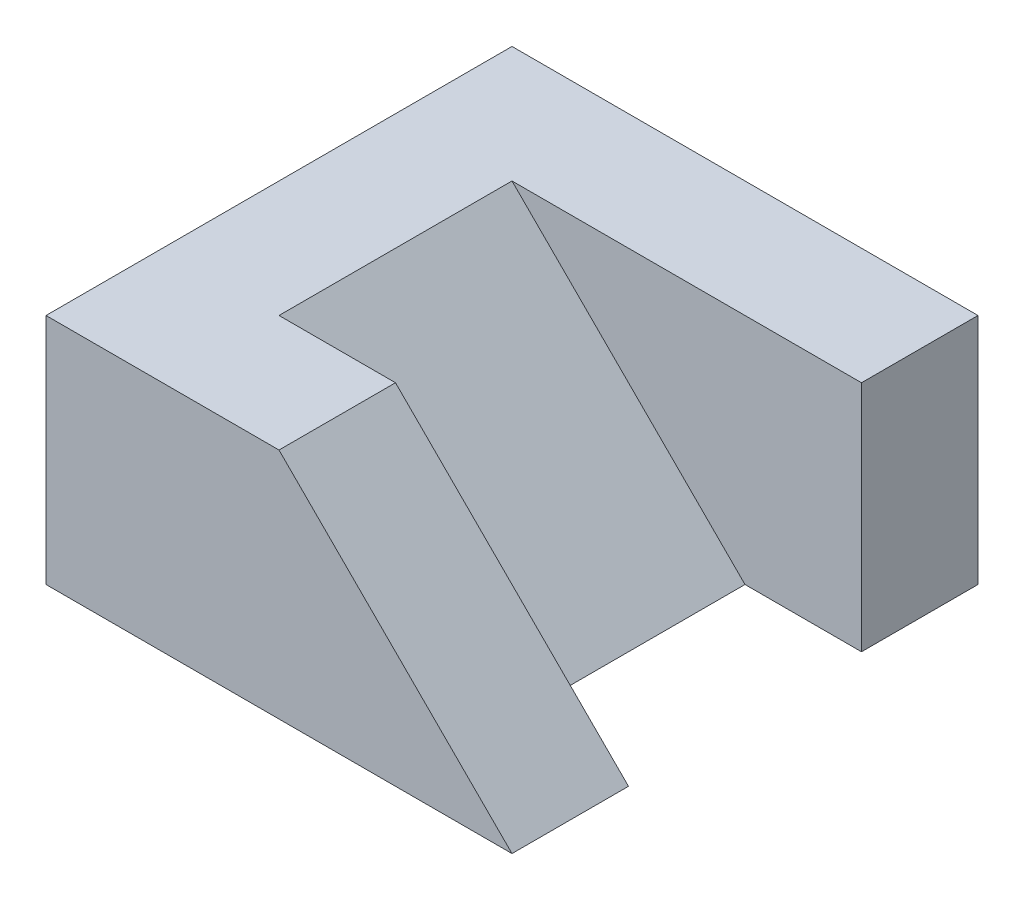
ISO-10303-21;
HEADER;
FILE_DESCRIPTION(('STEP AP214'),'2;1');
FILE_NAME('part.step','',(''),(''),'','','');
FILE_SCHEMA(('AUTOMOTIVE_DESIGN { 1 0 10303 214 1 1 1 1 }'));
ENDSEC;
DATA;
#1=APPLICATION_CONTEXT('core data for automotive mechanical design processes');
#2=APPLICATION_PROTOCOL_DEFINITION('international standard','automotive_design',2000,#1);
#3=PRODUCT_CONTEXT('',#1,'mechanical');
#4=PRODUCT('Part','Part','',(#3));
#5=PRODUCT_RELATED_PRODUCT_CATEGORY('part','',(#4));
#6=PRODUCT_DEFINITION_FORMATION('','',#4);
#7=PRODUCT_DEFINITION_CONTEXT('part definition',#1,'design');
#8=PRODUCT_DEFINITION('design','',#6,#7);
#9=PRODUCT_DEFINITION_SHAPE('','',#8);
#10=(LENGTH_UNIT() NAMED_UNIT(*) SI_UNIT(.MILLI.,.METRE.));
#11=(NAMED_UNIT(*) PLANE_ANGLE_UNIT() SI_UNIT($,.RADIAN.));
#12=(NAMED_UNIT(*) SI_UNIT($,.STERADIAN.) SOLID_ANGLE_UNIT());
#13=UNCERTAINTY_MEASURE_WITH_UNIT(LENGTH_MEASURE(1.E-05),#10,'distance_accuracy_value','');
#14=(GEOMETRIC_REPRESENTATION_CONTEXT(3) GLOBAL_UNCERTAINTY_ASSIGNED_CONTEXT((#13)) GLOBAL_UNIT_ASSIGNED_CONTEXT((#10,
#11,#12)) REPRESENTATION_CONTEXT('',''));
#15=CARTESIAN_POINT('',(0.,0.,0.));
#16=DIRECTION('',(0.,0.,1.));
#17=DIRECTION('',(1.,0.,0.));
#18=AXIS2_PLACEMENT_3D('',#15,#16,#17);
#19=CARTESIAN_POINT('',(-1.81818181818182,5.63636363636364,-0.545454545454544));
#20=DIRECTION('',(0.,1.,0.));
#21=DIRECTION('',(0.,0.,1.));
#22=AXIS2_PLACEMENT_3D('',#19,#20,#21);
#23=PLANE('',#22);
#24=DIRECTION('',(0.,0.,1.));
#25=VECTOR('',#24,1.);
#26=CARTESIAN_POINT('',(-1.81818181818182,5.63636363636364,0.454545454545456));
#27=LINE('',#26,#25);
#28=CARTESIAN_POINT('',(-1.81818181818182,5.63636363636364,0.454545454545456));
#29=VERTEX_POINT('',#28);
#30=CARTESIAN_POINT('',(-1.81818181818182,5.63636363636364,1.45454545454546));
#31=VERTEX_POINT('',#30);
#32=EDGE_CURVE('E111',#29,#31,#27,.T.);
#33=ORIENTED_EDGE('',*,*,#32,.F.);
#34=DIRECTION('',(-1.,0.,0.));
#35=VECTOR('',#34,1.);
#36=CARTESIAN_POINT('',(-1.81818181818182,5.63636363636364,0.454545454545456));
#37=LINE('',#36,#35);
#38=CARTESIAN_POINT('',(-2.81818181818182,5.63636363636364,0.454545454545456));
#39=VERTEX_POINT('',#38);
#40=EDGE_CURVE('E120',#29,#39,#37,.T.);
#41=ORIENTED_EDGE('',*,*,#40,.T.);
#42=DIRECTION('',(0.,0.,1.));
#43=VECTOR('',#42,1.);
#44=CARTESIAN_POINT('',(-2.81818181818182,5.63636363636364,-1.54545454545454));
#45=LINE('',#44,#43);
#46=CARTESIAN_POINT('',(-2.81818181818182,5.63636363636364,-1.54545454545454));
#47=VERTEX_POINT('',#46);
#48=EDGE_CURVE('E135',#47,#39,#45,.T.);
#49=ORIENTED_EDGE('',*,*,#48,.F.);
#50=DIRECTION('',(-1.,0.,0.));
#51=VECTOR('',#50,1.);
#52=CARTESIAN_POINT('',(-1.81818181818182,5.63636363636364,-1.54545454545454));
#53=LINE('',#52,#51);
#54=CARTESIAN_POINT('',(0.181818181818184,5.63636363636364,-1.54545454545454));
#55=VERTEX_POINT('',#54);
#56=EDGE_CURVE('E150',#55,#47,#53,.T.);
#57=ORIENTED_EDGE('',*,*,#56,.F.);
#58=DIRECTION('',(0.,0.,1.));
#59=VECTOR('',#58,1.);
#60=CARTESIAN_POINT('',(0.181818181818184,5.63636363636364,-0.545454545454544));
#61=LINE('',#60,#59);
#62=CARTESIAN_POINT('',(0.181818181818184,5.63636363636364,-2.54545454545454));
#63=VERTEX_POINT('',#62);
#64=EDGE_CURVE('E167',#63,#55,#61,.T.);
#65=ORIENTED_EDGE('',*,*,#64,.F.);
#66=DIRECTION('',(-1.,0.,0.));
#67=VECTOR('',#66,1.);
#68=CARTESIAN_POINT('',(-1.81818181818182,5.63636363636364,-2.54545454545454));
#69=LINE('',#68,#67);
#70=CARTESIAN_POINT('',(-3.81818181818182,5.63636363636364,-2.54545454545454));
#71=VERTEX_POINT('',#70);
#72=EDGE_CURVE('E158',#63,#71,#69,.T.);
#73=ORIENTED_EDGE('',*,*,#72,.T.);
#74=DIRECTION('',(0.,0.,1.));
#75=VECTOR('',#74,1.);
#76=CARTESIAN_POINT('',(-3.81818181818182,5.63636363636364,-0.545454545454544));
#77=LINE('',#76,#75);
#78=CARTESIAN_POINT('',(-3.81818181818182,5.63636363636364,1.45454545454546));
#79=VERTEX_POINT('',#78);
#80=EDGE_CURVE('E127',#71,#79,#77,.T.);
#81=ORIENTED_EDGE('',*,*,#80,.T.);
#82=DIRECTION('',(-1.,0.,0.));
#83=VECTOR('',#82,1.);
#84=CARTESIAN_POINT('',(-1.81818181818182,5.63636363636364,1.45454545454546));
#85=LINE('',#84,#83);
#86=EDGE_CURVE('E55',#31,#79,#85,.T.);
#87=ORIENTED_EDGE('',*,*,#86,.F.);
#88=EDGE_LOOP('',(#33,#41,#49,#57,#65,#73,#81,#87));
#89=FACE_BOUND('',#88,.T.);
#90=ADVANCED_FACE('F38',(#89),#23,.T.);
#91=CARTESIAN_POINT('',(-1.81818181818182,5.63636363636364,-1.54545454545454));
#92=DIRECTION('',(0.,0.,1.));
#93=DIRECTION('',(1.,0.,0.));
#94=AXIS2_PLACEMENT_3D('',#91,#92,#93);
#95=PLANE('',#94);
#96=DIRECTION('',(-1.,0.,0.));
#97=VECTOR('',#96,1.);
#98=CARTESIAN_POINT('',(-1.81818181818182,3.63636363636364,-1.54545454545454));
#99=LINE('',#98,#97);
#100=CARTESIAN_POINT('',(0.181818181818184,3.63636363636364,-1.54545454545454));
#101=VERTEX_POINT('',#100);
#102=CARTESIAN_POINT('',(-0.818181818181816,3.63636363636364,-1.54545454545454));
#103=VERTEX_POINT('',#102);
#104=EDGE_CURVE('E134',#101,#103,#99,.T.);
#105=ORIENTED_EDGE('',*,*,#104,.F.);
#106=DIRECTION('',(0.,-1.,0.));
#107=VECTOR('',#106,1.);
#108=CARTESIAN_POINT('',(0.181818181818184,5.63636363636364,-1.54545454545454));
#109=LINE('',#108,#107);
#110=EDGE_CURVE('E11',#55,#101,#109,.T.);
#111=ORIENTED_EDGE('',*,*,#110,.F.);
#112=ORIENTED_EDGE('',*,*,#56,.T.);
#113=DIRECTION('',(0.707106781186547,-0.707106781186548,0.));
#114=VECTOR('',#113,1.);
#115=CARTESIAN_POINT('',(-2.81818181818182,5.63636363636364,-1.54545454545454));
#116=LINE('',#115,#114);
#117=EDGE_CURVE('E170',#47,#103,#116,.T.);
#118=ORIENTED_EDGE('',*,*,#117,.T.);
#119=EDGE_LOOP('',(#105,#111,#112,#118));
#120=FACE_BOUND('',#119,.T.);
#121=ADVANCED_FACE('F40',(#120),#95,.T.);
#122=CARTESIAN_POINT('',(0.181818181818184,5.63636363636364,-0.545454545454544));
#123=DIRECTION('',(1.,0.,0.));
#124=DIRECTION('',(0.,0.,-1.));
#125=AXIS2_PLACEMENT_3D('',#122,#123,#124);
#126=PLANE('',#125);
#127=DIRECTION('',(0.,0.,1.));
#128=VECTOR('',#127,1.);
#129=CARTESIAN_POINT('',(0.181818181818184,3.63636363636364,-0.545454545454544));
#130=LINE('',#129,#128);
#131=CARTESIAN_POINT('',(0.181818181818184,3.63636363636364,-2.54545454545454));
#132=VERTEX_POINT('',#131);
#133=EDGE_CURVE('E138',#132,#101,#130,.T.);
#134=ORIENTED_EDGE('',*,*,#133,.F.);
#135=DIRECTION('',(0.,-1.,0.));
#136=VECTOR('',#135,1.);
#137=CARTESIAN_POINT('',(0.181818181818184,5.63636363636364,-2.54545454545454));
#138=LINE('',#137,#136);
#139=EDGE_CURVE('E47',#63,#132,#138,.T.);
#140=ORIENTED_EDGE('',*,*,#139,.F.);
#141=ORIENTED_EDGE('',*,*,#64,.T.);
#142=ORIENTED_EDGE('',*,*,#110,.T.);
#143=EDGE_LOOP('',(#134,#140,#141,#142));
#144=FACE_BOUND('',#143,.T.);
#145=ADVANCED_FACE('F166',(#144),#126,.T.);
#146=CARTESIAN_POINT('',(-1.81818181818182,5.63636363636364,-2.54545454545454));
#147=DIRECTION('',(0.,0.,1.));
#148=DIRECTION('',(1.,0.,0.));
#149=AXIS2_PLACEMENT_3D('',#146,#147,#148);
#150=PLANE('',#149);
#151=DIRECTION('',(-1.,0.,0.));
#152=VECTOR('',#151,1.);
#153=CARTESIAN_POINT('',(-1.81818181818182,3.63636363636364,-2.54545454545454));
#154=LINE('',#153,#152);
#155=CARTESIAN_POINT('',(-3.81818181818182,3.63636363636364,-2.54545454545454));
#156=VERTEX_POINT('',#155);
#157=EDGE_CURVE('E141',#132,#156,#154,.T.);
#158=ORIENTED_EDGE('',*,*,#157,.T.);
#159=DIRECTION('',(0.,-1.,0.));
#160=VECTOR('',#159,1.);
#161=CARTESIAN_POINT('',(-3.81818181818182,5.63636363636364,-2.54545454545454));
#162=LINE('',#161,#160);
#163=EDGE_CURVE('E125',#71,#156,#162,.T.);
#164=ORIENTED_EDGE('',*,*,#163,.F.);
#165=ORIENTED_EDGE('',*,*,#72,.F.);
#166=ORIENTED_EDGE('',*,*,#139,.T.);
#167=EDGE_LOOP('',(#158,#164,#165,#166));
#168=FACE_BOUND('',#167,.T.);
#169=ADVANCED_FACE('F156',(#168),#150,.F.);
#170=CARTESIAN_POINT('',(-3.81818181818182,5.63636363636364,-0.545454545454544));
#171=DIRECTION('',(1.,0.,0.));
#172=DIRECTION('',(0.,0.,-1.));
#173=AXIS2_PLACEMENT_3D('',#170,#171,#172);
#174=PLANE('',#173);
#175=DIRECTION('',(0.,0.,1.));
#176=VECTOR('',#175,1.);
#177=CARTESIAN_POINT('',(-3.81818181818182,3.63636363636364,-0.545454545454544));
#178=LINE('',#177,#176);
#179=CARTESIAN_POINT('',(-3.81818181818182,3.63636363636364,1.45454545454546));
#180=VERTEX_POINT('',#179);
#181=EDGE_CURVE('E143',#156,#180,#178,.T.);
#182=ORIENTED_EDGE('',*,*,#181,.T.);
#183=DIRECTION('',(0.,-1.,0.));
#184=VECTOR('',#183,1.);
#185=CARTESIAN_POINT('',(-3.81818181818182,5.63636363636364,1.45454545454546));
#186=LINE('',#185,#184);
#187=EDGE_CURVE('E123',#79,#180,#186,.T.);
#188=ORIENTED_EDGE('',*,*,#187,.F.);
#189=ORIENTED_EDGE('',*,*,#80,.F.);
#190=ORIENTED_EDGE('',*,*,#163,.T.);
#191=EDGE_LOOP('',(#182,#188,#189,#190));
#192=FACE_BOUND('',#191,.T.);
#193=ADVANCED_FACE('F181',(#192),#174,.F.);
#194=CARTESIAN_POINT('',(-1.81818181818182,5.63636363636364,1.45454545454546));
#195=DIRECTION('',(0.,0.,1.));
#196=DIRECTION('',(1.,0.,0.));
#197=AXIS2_PLACEMENT_3D('',#194,#195,#196);
#198=PLANE('',#197);
#199=DIRECTION('',(0.707106781186548,-0.707106781186548,0.));
#200=VECTOR('',#199,1.);
#201=CARTESIAN_POINT('',(-1.81818181818182,5.63636363636364,1.45454545454546));
#202=LINE('',#201,#200);
#203=CARTESIAN_POINT('',(0.181818181818184,3.63636363636364,1.45454545454546));
#204=VERTEX_POINT('',#203);
#205=EDGE_CURVE('E77',#31,#204,#202,.T.);
#206=ORIENTED_EDGE('',*,*,#205,.F.);
#207=ORIENTED_EDGE('',*,*,#86,.T.);
#208=ORIENTED_EDGE('',*,*,#187,.T.);
#209=DIRECTION('',(-1.,0.,0.));
#210=VECTOR('',#209,1.);
#211=CARTESIAN_POINT('',(-1.81818181818182,3.63636363636364,1.45454545454546));
#212=LINE('',#211,#210);
#213=EDGE_CURVE('E146',#204,#180,#212,.T.);
#214=ORIENTED_EDGE('',*,*,#213,.F.);
#215=EDGE_LOOP('',(#206,#207,#208,#214));
#216=FACE_BOUND('',#215,.T.);
#217=ADVANCED_FACE('F182',(#216),#198,.T.);
#218=CARTESIAN_POINT('',(-1.81818181818182,5.63636363636364,0.454545454545456));
#219=DIRECTION('',(0.,0.,1.));
#220=DIRECTION('',(1.,0.,0.));
#221=AXIS2_PLACEMENT_3D('',#218,#219,#220);
#222=PLANE('',#221);
#223=ORIENTED_EDGE('',*,*,#40,.F.);
#224=DIRECTION('',(0.707106781186548,-0.707106781186548,0.));
#225=VECTOR('',#224,1.);
#226=CARTESIAN_POINT('',(-1.81818181818182,5.63636363636364,0.454545454545456));
#227=LINE('',#226,#225);
#228=CARTESIAN_POINT('',(0.181818181818184,3.63636363636364,0.454545454545456));
#229=VERTEX_POINT('',#228);
#230=EDGE_CURVE('E108',#29,#229,#227,.T.);
#231=ORIENTED_EDGE('',*,*,#230,.T.);
#232=DIRECTION('',(-1.,0.,0.));
#233=VECTOR('',#232,1.);
#234=CARTESIAN_POINT('',(-1.81818181818182,3.63636363636364,0.454545454545456));
#235=LINE('',#234,#233);
#236=CARTESIAN_POINT('',(-0.818181818181816,3.63636363636364,0.454545454545456));
#237=VERTEX_POINT('',#236);
#238=EDGE_CURVE('E149',#229,#237,#235,.T.);
#239=ORIENTED_EDGE('',*,*,#238,.T.);
#240=DIRECTION('',(0.707106781186547,-0.707106781186548,0.));
#241=VECTOR('',#240,1.);
#242=CARTESIAN_POINT('',(-2.81818181818182,5.63636363636364,0.454545454545456));
#243=LINE('',#242,#241);
#244=EDGE_CURVE('E85',#39,#237,#243,.T.);
#245=ORIENTED_EDGE('',*,*,#244,.F.);
#246=EDGE_LOOP('',(#223,#231,#239,#245));
#247=FACE_BOUND('',#246,.T.);
#248=ADVANCED_FACE('F122',(#247),#222,.F.);
#249=CARTESIAN_POINT('',(-1.81818181818182,3.63636363636364,-0.545454545454544));
#250=DIRECTION('',(0.,1.,0.));
#251=DIRECTION('',(0.,0.,1.));
#252=AXIS2_PLACEMENT_3D('',#249,#250,#251);
#253=PLANE('',#252);
#254=DIRECTION('',(0.,0.,1.));
#255=VECTOR('',#254,1.);
#256=CARTESIAN_POINT('',(-0.818181818181816,3.63636363636364,-0.545454545454544));
#257=LINE('',#256,#255);
#258=EDGE_CURVE('E131',#103,#237,#257,.T.);
#259=ORIENTED_EDGE('',*,*,#258,.T.);
#260=ORIENTED_EDGE('',*,*,#238,.F.);
#261=EDGE_CURVE('E113',#229,#204,#130,.T.);
#262=ORIENTED_EDGE('',*,*,#261,.T.);
#263=ORIENTED_EDGE('',*,*,#213,.T.);
#264=ORIENTED_EDGE('',*,*,#181,.F.);
#265=ORIENTED_EDGE('',*,*,#157,.F.);
#266=ORIENTED_EDGE('',*,*,#133,.T.);
#267=ORIENTED_EDGE('',*,*,#104,.T.);
#268=EDGE_LOOP('',(#259,#260,#262,#263,#264,#265,#266,#267));
#269=FACE_BOUND('',#268,.T.);
#270=ADVANCED_FACE('F165',(#269),#253,.F.);
#271=CARTESIAN_POINT('',(-2.81818181818182,5.63636363636364,-1.54545454545454));
#272=DIRECTION('',(-0.707106781186548,-0.707106781186547,0.));
#273=DIRECTION('',(0.707106781186547,-0.707106781186548,0.));
#274=AXIS2_PLACEMENT_3D('',#271,#272,#273);
#275=PLANE('',#274);
#276=ORIENTED_EDGE('',*,*,#244,.T.);
#277=ORIENTED_EDGE('',*,*,#258,.F.);
#278=ORIENTED_EDGE('',*,*,#117,.F.);
#279=ORIENTED_EDGE('',*,*,#48,.T.);
#280=EDGE_LOOP('',(#276,#277,#278,#279));
#281=FACE_BOUND('',#280,.T.);
#282=ADVANCED_FACE('F171',(#281),#275,.F.);
#283=CARTESIAN_POINT('',(-1.81818181818182,5.63636363636364,0.454545454545456));
#284=DIRECTION('',(-0.707106781186548,-0.707106781186548,0.));
#285=DIRECTION('',(0.707106781186548,-0.707106781186548,0.));
#286=AXIS2_PLACEMENT_3D('',#283,#284,#285);
#287=PLANE('',#286);
#288=ORIENTED_EDGE('',*,*,#205,.T.);
#289=ORIENTED_EDGE('',*,*,#261,.F.);
#290=ORIENTED_EDGE('',*,*,#230,.F.);
#291=ORIENTED_EDGE('',*,*,#32,.T.);
#292=EDGE_LOOP('',(#288,#289,#290,#291));
#293=FACE_BOUND('',#292,.T.);
#294=ADVANCED_FACE('F110',(#293),#287,.F.);
#295=CLOSED_SHELL('',(#90,#121,#145,#169,#193,#217,#248,#270,#282,#294));
#296=MANIFOLD_SOLID_BREP('B2',#295);
#297=ADVANCED_BREP_SHAPE_REPRESENTATION('',(#18,#296),#14);
#298=SHAPE_DEFINITION_REPRESENTATION(#9,#297);
ENDSEC;
END-ISO-10303-21;
